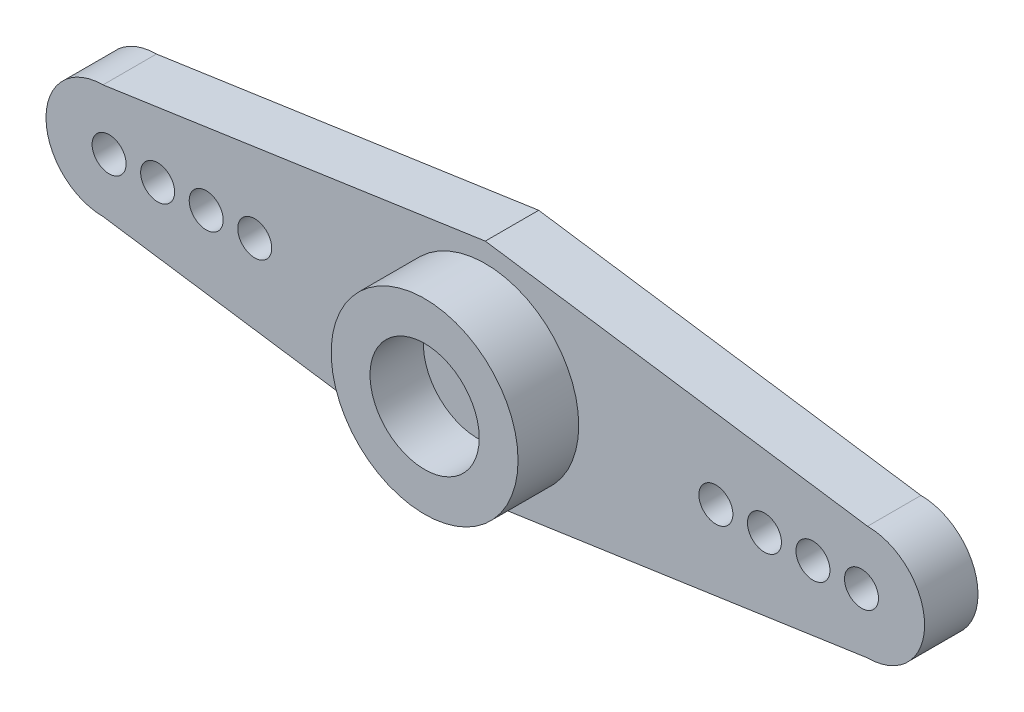
ISO-10303-21;
HEADER;
FILE_DESCRIPTION(('STEP AP214'),'2;1');
FILE_NAME('part.step','',(''),(''),'','','');
FILE_SCHEMA(('AUTOMOTIVE_DESIGN { 1 0 10303 214 1 1 1 1 }'));
ENDSEC;
DATA;
#1=APPLICATION_CONTEXT('core data for automotive mechanical design processes');
#2=APPLICATION_PROTOCOL_DEFINITION('international standard','automotive_design',2000,#1);
#3=PRODUCT_CONTEXT('',#1,'mechanical');
#4=PRODUCT('Part','Part','',(#3));
#5=PRODUCT_RELATED_PRODUCT_CATEGORY('part','',(#4));
#6=PRODUCT_DEFINITION_FORMATION('','',#4);
#7=PRODUCT_DEFINITION_CONTEXT('part definition',#1,'design');
#8=PRODUCT_DEFINITION('design','',#6,#7);
#9=PRODUCT_DEFINITION_SHAPE('','',#8);
#10=(LENGTH_UNIT() NAMED_UNIT(*) SI_UNIT(.MILLI.,.METRE.));
#11=(NAMED_UNIT(*) PLANE_ANGLE_UNIT() SI_UNIT($,.RADIAN.));
#12=(NAMED_UNIT(*) SI_UNIT($,.STERADIAN.) SOLID_ANGLE_UNIT());
#13=UNCERTAINTY_MEASURE_WITH_UNIT(LENGTH_MEASURE(1.E-05),#10,'distance_accuracy_value','');
#14=(GEOMETRIC_REPRESENTATION_CONTEXT(3) GLOBAL_UNCERTAINTY_ASSIGNED_CONTEXT((#13)) GLOBAL_UNIT_ASSIGNED_CONTEXT((#10,
#11,#12)) REPRESENTATION_CONTEXT('',''));
#15=CARTESIAN_POINT('',(0.,0.,0.));
#16=DIRECTION('',(0.,0.,1.));
#17=DIRECTION('',(1.,0.,0.));
#18=AXIS2_PLACEMENT_3D('',#15,#16,#17);
#19=CARTESIAN_POINT('',(22.987,5.9055,0.));
#20=DIRECTION('',(0.,0.,-1.));
#21=DIRECTION('',(-1.,0.,0.));
#22=AXIS2_PLACEMENT_3D('',#19,#20,#21);
#23=PLANE('',#22);
#24=CARTESIAN_POINT('',(-19.685,0.,0.));
#25=DIRECTION('',(0.,0.,-1.));
#26=DIRECTION('',(-1.,0.,0.));
#27=AXIS2_PLACEMENT_3D('',#24,#25,#26);
#28=CIRCLE('',#27,0.888999999999987);
#29=CARTESIAN_POINT('',(-20.574,0.,0.));
#30=VERTEX_POINT('',#29);
#31=EDGE_CURVE('E139',#30,#30,#28,.T.);
#32=ORIENTED_EDGE('',*,*,#31,.F.);
#33=EDGE_LOOP('',(#32));
#34=FACE_BOUND('',#33,.T.);
#35=CARTESIAN_POINT('',(-17.145,0.,0.));
#36=DIRECTION('',(0.,0.,-1.));
#37=DIRECTION('',(-1.,0.,0.));
#38=AXIS2_PLACEMENT_3D('',#35,#36,#37);
#39=CIRCLE('',#38,0.888999999999987);
#40=CARTESIAN_POINT('',(-18.034,0.,0.));
#41=VERTEX_POINT('',#40);
#42=EDGE_CURVE('E143',#41,#41,#39,.T.);
#43=ORIENTED_EDGE('',*,*,#42,.F.);
#44=EDGE_LOOP('',(#43));
#45=FACE_BOUND('',#44,.T.);
#46=CARTESIAN_POINT('',(-14.605,0.,0.));
#47=DIRECTION('',(0.,0.,-1.));
#48=DIRECTION('',(-1.,0.,0.));
#49=AXIS2_PLACEMENT_3D('',#46,#47,#48);
#50=CIRCLE('',#49,0.888999999999989);
#51=CARTESIAN_POINT('',(-15.494,0.,0.));
#52=VERTEX_POINT('',#51);
#53=EDGE_CURVE('E147',#52,#52,#50,.T.);
#54=ORIENTED_EDGE('',*,*,#53,.F.);
#55=EDGE_LOOP('',(#54));
#56=FACE_BOUND('',#55,.T.);
#57=CARTESIAN_POINT('',(-12.065,0.,0.));
#58=DIRECTION('',(0.,0.,-1.));
#59=DIRECTION('',(-1.,0.,0.));
#60=AXIS2_PLACEMENT_3D('',#57,#58,#59);
#61=CIRCLE('',#60,0.888999999999989);
#62=CARTESIAN_POINT('',(-12.954,0.,0.));
#63=VERTEX_POINT('',#62);
#64=EDGE_CURVE('E151',#63,#63,#61,.T.);
#65=ORIENTED_EDGE('',*,*,#64,.F.);
#66=EDGE_LOOP('',(#65));
#67=FACE_BOUND('',#66,.T.);
#68=CARTESIAN_POINT('',(19.685,0.,0.));
#69=DIRECTION('',(0.,0.,-1.));
#70=DIRECTION('',(-1.,0.,0.));
#71=AXIS2_PLACEMENT_3D('',#68,#69,#70);
#72=CIRCLE('',#71,0.888999999999987);
#73=CARTESIAN_POINT('',(18.796,0.,0.));
#74=VERTEX_POINT('',#73);
#75=EDGE_CURVE('E155',#74,#74,#72,.T.);
#76=ORIENTED_EDGE('',*,*,#75,.F.);
#77=EDGE_LOOP('',(#76));
#78=FACE_BOUND('',#77,.T.);
#79=CARTESIAN_POINT('',(17.145,0.,0.));
#80=DIRECTION('',(0.,0.,-1.));
#81=DIRECTION('',(-1.,0.,0.));
#82=AXIS2_PLACEMENT_3D('',#79,#80,#81);
#83=CIRCLE('',#82,0.888999999999987);
#84=CARTESIAN_POINT('',(16.256,0.,0.));
#85=VERTEX_POINT('',#84);
#86=EDGE_CURVE('E160',#85,#85,#83,.T.);
#87=ORIENTED_EDGE('',*,*,#86,.F.);
#88=EDGE_LOOP('',(#87));
#89=FACE_BOUND('',#88,.T.);
#90=CARTESIAN_POINT('',(14.605,0.,0.));
#91=DIRECTION('',(0.,0.,-1.));
#92=DIRECTION('',(-1.,0.,0.));
#93=AXIS2_PLACEMENT_3D('',#90,#91,#92);
#94=CIRCLE('',#93,0.888999999999989);
#95=CARTESIAN_POINT('',(13.716,0.,0.));
#96=VERTEX_POINT('',#95);
#97=EDGE_CURVE('E165',#96,#96,#94,.T.);
#98=ORIENTED_EDGE('',*,*,#97,.F.);
#99=EDGE_LOOP('',(#98));
#100=FACE_BOUND('',#99,.T.);
#101=CARTESIAN_POINT('',(12.065,0.,0.));
#102=DIRECTION('',(0.,0.,-1.));
#103=DIRECTION('',(-1.,0.,0.));
#104=AXIS2_PLACEMENT_3D('',#101,#102,#103);
#105=CIRCLE('',#104,0.888999999999989);
#106=CARTESIAN_POINT('',(11.176,0.,0.));
#107=VERTEX_POINT('',#106);
#108=EDGE_CURVE('E170',#107,#107,#105,.T.);
#109=ORIENTED_EDGE('',*,*,#108,.F.);
#110=EDGE_LOOP('',(#109));
#111=FACE_BOUND('',#110,.T.);
#112=CARTESIAN_POINT('',(20.0025,0.,0.));
#113=DIRECTION('',(0.,0.,1.));
#114=DIRECTION('',(-1.,0.,0.));
#115=AXIS2_PLACEMENT_3D('',#112,#113,#114);
#116=CIRCLE('',#115,2.9845);
#117=CARTESIAN_POINT('',(20.0025,-2.9845,0.));
#118=VERTEX_POINT('',#117);
#119=CARTESIAN_POINT('',(20.0025,2.9845,0.));
#120=VERTEX_POINT('',#119);
#121=EDGE_CURVE('E57',#118,#120,#116,.T.);
#122=ORIENTED_EDGE('',*,*,#121,.F.);
#123=DIRECTION('',(0.9895049271173,0.144499132213955,0.));
#124=VECTOR('',#123,1.);
#125=CARTESIAN_POINT('',(20.0025,-2.9845,0.));
#126=LINE('',#125,#124);
#127=CARTESIAN_POINT('',(-1.48999871685609E-13,-5.90549999999999,0.));
#128=VERTEX_POINT('',#127);
#129=EDGE_CURVE('E118',#128,#118,#126,.T.);
#130=ORIENTED_EDGE('',*,*,#129,.F.);
#131=DIRECTION('',(-0.9895049271173,0.144499132213955,0.));
#132=VECTOR('',#131,1.);
#133=CARTESIAN_POINT('',(-20.0025,-2.9845,0.));
#134=LINE('',#133,#132);
#135=CARTESIAN_POINT('',(-20.0025,-2.9845,0.));
#136=VERTEX_POINT('',#135);
#137=EDGE_CURVE('E133',#128,#136,#134,.T.);
#138=ORIENTED_EDGE('',*,*,#137,.T.);
#139=CARTESIAN_POINT('',(-20.0025,0.,0.));
#140=DIRECTION('',(0.,0.,-1.));
#141=DIRECTION('',(1.,0.,0.));
#142=AXIS2_PLACEMENT_3D('',#139,#140,#141);
#143=CIRCLE('',#142,2.9845);
#144=CARTESIAN_POINT('',(-20.0025,2.9845,0.));
#145=VERTEX_POINT('',#144);
#146=EDGE_CURVE('E128',#136,#145,#143,.T.);
#147=ORIENTED_EDGE('',*,*,#146,.T.);
#148=DIRECTION('',(0.9895049271173,0.144499132213955,0.));
#149=VECTOR('',#148,1.);
#150=CARTESIAN_POINT('',(-20.0025,2.9845,0.));
#151=LINE('',#150,#149);
#152=CARTESIAN_POINT('',(0.,5.90549999999999,0.));
#153=VERTEX_POINT('',#152);
#154=EDGE_CURVE('E124',#145,#153,#151,.T.);
#155=ORIENTED_EDGE('',*,*,#154,.T.);
#156=DIRECTION('',(-0.9895049271173,0.144499132213955,0.));
#157=VECTOR('',#156,1.);
#158=CARTESIAN_POINT('',(20.0025,2.9845,0.));
#159=LINE('',#158,#157);
#160=EDGE_CURVE('E121',#120,#153,#159,.T.);
#161=ORIENTED_EDGE('',*,*,#160,.F.);
#162=EDGE_LOOP('',(#122,#130,#138,#147,#155,#161));
#163=FACE_BOUND('',#162,.T.);
#164=ADVANCED_FACE('F39',(#34,#45,#56,#67,#78,#89,#100,#111,#163),#23,.T.);
#165=CARTESIAN_POINT('',(0.,0.,2.794));
#166=DIRECTION('',(0.,0.,1.));
#167=DIRECTION('',(1.,0.,0.));
#168=AXIS2_PLACEMENT_3D('',#165,#166,#167);
#169=PLANE('',#168);
#170=CARTESIAN_POINT('',(-19.685,0.,2.794));
#171=DIRECTION('',(0.,0.,1.));
#172=DIRECTION('',(1.,0.,0.));
#173=AXIS2_PLACEMENT_3D('',#170,#171,#172);
#174=CIRCLE('',#173,0.888999999999987);
#175=CARTESIAN_POINT('',(-18.796,0.,2.794));
#176=VERTEX_POINT('',#175);
#177=EDGE_CURVE('E142',#176,#176,#174,.T.);
#178=ORIENTED_EDGE('',*,*,#177,.F.);
#179=EDGE_LOOP('',(#178));
#180=FACE_BOUND('',#179,.T.);
#181=CARTESIAN_POINT('',(-17.145,0.,2.794));
#182=DIRECTION('',(0.,0.,1.));
#183=DIRECTION('',(1.,0.,0.));
#184=AXIS2_PLACEMENT_3D('',#181,#182,#183);
#185=CIRCLE('',#184,0.888999999999987);
#186=CARTESIAN_POINT('',(-16.256,0.,2.794));
#187=VERTEX_POINT('',#186);
#188=EDGE_CURVE('E146',#187,#187,#185,.T.);
#189=ORIENTED_EDGE('',*,*,#188,.F.);
#190=EDGE_LOOP('',(#189));
#191=FACE_BOUND('',#190,.T.);
#192=CARTESIAN_POINT('',(-14.605,0.,2.794));
#193=DIRECTION('',(0.,0.,1.));
#194=DIRECTION('',(1.,0.,0.));
#195=AXIS2_PLACEMENT_3D('',#192,#193,#194);
#196=CIRCLE('',#195,0.888999999999988);
#197=CARTESIAN_POINT('',(-13.716,0.,2.794));
#198=VERTEX_POINT('',#197);
#199=EDGE_CURVE('E150',#198,#198,#196,.T.);
#200=ORIENTED_EDGE('',*,*,#199,.F.);
#201=EDGE_LOOP('',(#200));
#202=FACE_BOUND('',#201,.T.);
#203=CARTESIAN_POINT('',(-12.065,0.,2.794));
#204=DIRECTION('',(0.,0.,1.));
#205=DIRECTION('',(1.,0.,0.));
#206=AXIS2_PLACEMENT_3D('',#203,#204,#205);
#207=CIRCLE('',#206,0.888999999999988);
#208=CARTESIAN_POINT('',(-11.176,0.,2.794));
#209=VERTEX_POINT('',#208);
#210=EDGE_CURVE('E154',#209,#209,#207,.T.);
#211=ORIENTED_EDGE('',*,*,#210,.F.);
#212=EDGE_LOOP('',(#211));
#213=FACE_BOUND('',#212,.T.);
#214=CARTESIAN_POINT('',(19.685,0.,2.794));
#215=DIRECTION('',(0.,0.,1.));
#216=DIRECTION('',(1.,0.,0.));
#217=AXIS2_PLACEMENT_3D('',#214,#215,#216);
#218=CIRCLE('',#217,0.888999999999987);
#219=CARTESIAN_POINT('',(20.574,0.,2.794));
#220=VERTEX_POINT('',#219);
#221=EDGE_CURVE('E159',#220,#220,#218,.T.);
#222=ORIENTED_EDGE('',*,*,#221,.F.);
#223=EDGE_LOOP('',(#222));
#224=FACE_BOUND('',#223,.T.);
#225=CARTESIAN_POINT('',(17.145,0.,2.794));
#226=DIRECTION('',(0.,0.,1.));
#227=DIRECTION('',(1.,0.,0.));
#228=AXIS2_PLACEMENT_3D('',#225,#226,#227);
#229=CIRCLE('',#228,0.888999999999987);
#230=CARTESIAN_POINT('',(18.034,0.,2.794));
#231=VERTEX_POINT('',#230);
#232=EDGE_CURVE('E164',#231,#231,#229,.T.);
#233=ORIENTED_EDGE('',*,*,#232,.F.);
#234=EDGE_LOOP('',(#233));
#235=FACE_BOUND('',#234,.T.);
#236=CARTESIAN_POINT('',(14.605,0.,2.794));
#237=DIRECTION('',(0.,0.,1.));
#238=DIRECTION('',(1.,0.,0.));
#239=AXIS2_PLACEMENT_3D('',#236,#237,#238);
#240=CIRCLE('',#239,0.888999999999988);
#241=CARTESIAN_POINT('',(15.494,0.,2.794));
#242=VERTEX_POINT('',#241);
#243=EDGE_CURVE('E169',#242,#242,#240,.T.);
#244=ORIENTED_EDGE('',*,*,#243,.F.);
#245=EDGE_LOOP('',(#244));
#246=FACE_BOUND('',#245,.T.);
#247=CARTESIAN_POINT('',(12.065,0.,2.794));
#248=DIRECTION('',(0.,0.,1.));
#249=DIRECTION('',(1.,0.,0.));
#250=AXIS2_PLACEMENT_3D('',#247,#248,#249);
#251=CIRCLE('',#250,0.888999999999988);
#252=CARTESIAN_POINT('',(12.954,0.,2.794));
#253=VERTEX_POINT('',#252);
#254=EDGE_CURVE('E174',#253,#253,#251,.T.);
#255=ORIENTED_EDGE('',*,*,#254,.F.);
#256=EDGE_LOOP('',(#255));
#257=FACE_BOUND('',#256,.T.);
#258=CARTESIAN_POINT('',(0.,0.,2.794));
#259=DIRECTION('',(0.,0.,1.));
#260=DIRECTION('',(1.,0.,0.));
#261=AXIS2_PLACEMENT_3D('',#258,#259,#260);
#262=CIRCLE('',#261,4.8895);
#263=CARTESIAN_POINT('',(4.8895,0.,2.794));
#264=VERTEX_POINT('',#263);
#265=EDGE_CURVE('E108',#264,#264,#262,.T.);
#266=ORIENTED_EDGE('',*,*,#265,.F.);
#267=EDGE_LOOP('',(#266));
#268=FACE_BOUND('',#267,.T.);
#269=DIRECTION('',(-0.9895049271173,0.144499132213955,0.));
#270=VECTOR('',#269,1.);
#271=CARTESIAN_POINT('',(-0.844383763728395,-5.78219316466189,2.794));
#272=LINE('',#271,#270);
#273=CARTESIAN_POINT('',(-1.52993049696762E-13,-5.90549999999999,2.794));
#274=VERTEX_POINT('',#273);
#275=CARTESIAN_POINT('',(-20.0025,-2.9845,2.794));
#276=VERTEX_POINT('',#275);
#277=EDGE_CURVE('E47',#274,#276,#272,.T.);
#278=ORIENTED_EDGE('',*,*,#277,.F.);
#279=DIRECTION('',(0.9895049271173,0.144499132213955,0.));
#280=VECTOR('',#279,1.);
#281=CARTESIAN_POINT('',(0.844383763728409,-5.78219316466188,2.794));
#282=LINE('',#281,#280);
#283=CARTESIAN_POINT('',(20.0025,-2.9845,2.794));
#284=VERTEX_POINT('',#283);
#285=EDGE_CURVE('E117',#274,#284,#282,.T.);
#286=ORIENTED_EDGE('',*,*,#285,.T.);
#287=CARTESIAN_POINT('',(20.0025,0.,2.794));
#288=DIRECTION('',(0.,0.,1.));
#289=DIRECTION('',(1.,0.,0.));
#290=AXIS2_PLACEMENT_3D('',#287,#288,#289);
#291=CIRCLE('',#290,2.9845);
#292=CARTESIAN_POINT('',(20.0025,2.9845,2.794));
#293=VERTEX_POINT('',#292);
#294=EDGE_CURVE('E12',#284,#293,#291,.T.);
#295=ORIENTED_EDGE('',*,*,#294,.T.);
#296=DIRECTION('',(-0.9895049271173,0.144499132213955,0.));
#297=VECTOR('',#296,1.);
#298=CARTESIAN_POINT('',(0.844383763728408,5.78219316466188,2.794));
#299=LINE('',#298,#297);
#300=CARTESIAN_POINT('',(0.,5.9055,2.794));
#301=VERTEX_POINT('',#300);
#302=EDGE_CURVE('E111',#293,#301,#299,.T.);
#303=ORIENTED_EDGE('',*,*,#302,.T.);
#304=DIRECTION('',(0.9895049271173,0.144499132213955,0.));
#305=VECTOR('',#304,1.);
#306=CARTESIAN_POINT('',(-0.844383763728395,5.78219316466188,2.794));
#307=LINE('',#306,#305);
#308=CARTESIAN_POINT('',(-20.0025,2.9845,2.794));
#309=VERTEX_POINT('',#308);
#310=EDGE_CURVE('E95',#309,#301,#307,.T.);
#311=ORIENTED_EDGE('',*,*,#310,.F.);
#312=CARTESIAN_POINT('',(-20.0025,0.,2.794));
#313=DIRECTION('',(0.,0.,1.));
#314=DIRECTION('',(1.,0.,0.));
#315=AXIS2_PLACEMENT_3D('',#312,#313,#314);
#316=CIRCLE('',#315,2.9845);
#317=EDGE_CURVE('E107',#276,#309,#316,.F.);
#318=ORIENTED_EDGE('',*,*,#317,.F.);
#319=EDGE_LOOP('',(#278,#286,#295,#303,#311,#318));
#320=FACE_BOUND('',#319,.T.);
#321=ADVANCED_FACE('F112',(#180,#191,#202,#213,#224,#235,#246,#257,#268,#320),#169,.T.);
#322=CARTESIAN_POINT('',(0.,0.,2.794));
#323=DIRECTION('',(0.,0.,1.));
#324=DIRECTION('',(1.,0.,0.));
#325=AXIS2_PLACEMENT_3D('',#322,#323,#324);
#326=CYLINDRICAL_SURFACE('',#325,4.8895);
#327=ORIENTED_EDGE('',*,*,#265,.T.);
#328=EDGE_LOOP('',(#327));
#329=FACE_BOUND('',#328,.T.);
#330=CARTESIAN_POINT('',(0.,0.,5.969));
#331=DIRECTION('',(0.,0.,1.));
#332=DIRECTION('',(1.,0.,0.));
#333=AXIS2_PLACEMENT_3D('',#330,#331,#332);
#334=CIRCLE('',#333,4.8895);
#335=CARTESIAN_POINT('',(4.8895,0.,5.969));
#336=VERTEX_POINT('',#335);
#337=EDGE_CURVE('E179',#336,#336,#334,.T.);
#338=ORIENTED_EDGE('',*,*,#337,.F.);
#339=EDGE_LOOP('',(#338));
#340=FACE_BOUND('',#339,.T.);
#341=ADVANCED_FACE('F243',(#329,#340),#326,.T.);
#342=CARTESIAN_POINT('',(22.987,5.9055,5.969));
#343=DIRECTION('',(0.,0.,-1.));
#344=DIRECTION('',(-1.,0.,0.));
#345=AXIS2_PLACEMENT_3D('',#342,#343,#344);
#346=PLANE('',#345);
#347=CARTESIAN_POINT('',(0.,0.,5.969));
#348=DIRECTION('',(0.,0.,1.));
#349=DIRECTION('',(1.,0.,0.));
#350=AXIS2_PLACEMENT_3D('',#347,#348,#349);
#351=CIRCLE('',#350,2.8575);
#352=CARTESIAN_POINT('',(2.8575,0.,5.969));
#353=VERTEX_POINT('',#352);
#354=EDGE_CURVE('E180',#353,#353,#351,.T.);
#355=ORIENTED_EDGE('',*,*,#354,.F.);
#356=EDGE_LOOP('',(#355));
#357=FACE_BOUND('',#356,.T.);
#358=ORIENTED_EDGE('',*,*,#337,.T.);
#359=EDGE_LOOP('',(#358));
#360=FACE_BOUND('',#359,.T.);
#361=ADVANCED_FACE('F282',(#357,#360),#346,.F.);
#362=CARTESIAN_POINT('',(0.,0.,3.175));
#363=DIRECTION('',(0.,0.,1.));
#364=DIRECTION('',(1.,0.,0.));
#365=AXIS2_PLACEMENT_3D('',#362,#363,#364);
#366=CYLINDRICAL_SURFACE('',#365,2.8575);
#367=CARTESIAN_POINT('',(0.,0.,3.175));
#368=DIRECTION('',(0.,0.,1.));
#369=DIRECTION('',(1.,0.,0.));
#370=AXIS2_PLACEMENT_3D('',#367,#368,#369);
#371=CIRCLE('',#370,2.8575);
#372=CARTESIAN_POINT('',(2.8575,0.,3.175));
#373=VERTEX_POINT('',#372);
#374=EDGE_CURVE('E175',#373,#373,#371,.T.);
#375=ORIENTED_EDGE('',*,*,#374,.F.);
#376=EDGE_LOOP('',(#375));
#377=FACE_BOUND('',#376,.T.);
#378=ORIENTED_EDGE('',*,*,#354,.T.);
#379=EDGE_LOOP('',(#378));
#380=FACE_BOUND('',#379,.T.);
#381=ADVANCED_FACE('F275',(#377,#380),#366,.F.);
#382=CARTESIAN_POINT('',(0.,0.,3.175));
#383=DIRECTION('',(0.,0.,1.));
#384=DIRECTION('',(1.,0.,0.));
#385=AXIS2_PLACEMENT_3D('',#382,#383,#384);
#386=PLANE('',#385);
#387=ORIENTED_EDGE('',*,*,#374,.T.);
#388=EDGE_LOOP('',(#387));
#389=FACE_BOUND('',#388,.T.);
#390=ADVANCED_FACE('F265',(#389),#386,.T.);
#391=CARTESIAN_POINT('',(12.065,0.,0.));
#392=DIRECTION('',(0.,0.,-1.));
#393=DIRECTION('',(-1.,0.,0.));
#394=AXIS2_PLACEMENT_3D('',#391,#392,#393);
#395=CYLINDRICAL_SURFACE('',#394,0.888999999999988);
#396=ORIENTED_EDGE('',*,*,#254,.T.);
#397=EDGE_LOOP('',(#396));
#398=FACE_BOUND('',#397,.T.);
#399=ORIENTED_EDGE('',*,*,#108,.T.);
#400=EDGE_LOOP('',(#399));
#401=FACE_BOUND('',#400,.T.);
#402=ADVANCED_FACE('F262',(#398,#401),#395,.F.);
#403=CARTESIAN_POINT('',(14.605,0.,0.));
#404=DIRECTION('',(0.,0.,-1.));
#405=DIRECTION('',(-1.,0.,0.));
#406=AXIS2_PLACEMENT_3D('',#403,#404,#405);
#407=CYLINDRICAL_SURFACE('',#406,0.888999999999988);
#408=ORIENTED_EDGE('',*,*,#243,.T.);
#409=EDGE_LOOP('',(#408));
#410=FACE_BOUND('',#409,.T.);
#411=ORIENTED_EDGE('',*,*,#97,.T.);
#412=EDGE_LOOP('',(#411));
#413=FACE_BOUND('',#412,.T.);
#414=ADVANCED_FACE('F264',(#410,#413),#407,.F.);
#415=CARTESIAN_POINT('',(17.145,0.,0.));
#416=DIRECTION('',(0.,0.,-1.));
#417=DIRECTION('',(-1.,0.,0.));
#418=AXIS2_PLACEMENT_3D('',#415,#416,#417);
#419=CYLINDRICAL_SURFACE('',#418,0.888999999999987);
#420=ORIENTED_EDGE('',*,*,#232,.T.);
#421=EDGE_LOOP('',(#420));
#422=FACE_BOUND('',#421,.T.);
#423=ORIENTED_EDGE('',*,*,#86,.T.);
#424=EDGE_LOOP('',(#423));
#425=FACE_BOUND('',#424,.T.);
#426=ADVANCED_FACE('F272',(#422,#425),#419,.F.);
#427=CARTESIAN_POINT('',(19.685,0.,0.));
#428=DIRECTION('',(0.,0.,-1.));
#429=DIRECTION('',(-1.,0.,0.));
#430=AXIS2_PLACEMENT_3D('',#427,#428,#429);
#431=CYLINDRICAL_SURFACE('',#430,0.888999999999987);
#432=ORIENTED_EDGE('',*,*,#221,.T.);
#433=EDGE_LOOP('',(#432));
#434=FACE_BOUND('',#433,.T.);
#435=ORIENTED_EDGE('',*,*,#75,.T.);
#436=EDGE_LOOP('',(#435));
#437=FACE_BOUND('',#436,.T.);
#438=ADVANCED_FACE('F324',(#434,#437),#431,.F.);
#439=CARTESIAN_POINT('',(-12.065,0.,0.));
#440=DIRECTION('',(0.,0.,-1.));
#441=DIRECTION('',(-1.,0.,0.));
#442=AXIS2_PLACEMENT_3D('',#439,#440,#441);
#443=CYLINDRICAL_SURFACE('',#442,0.888999999999988);
#444=ORIENTED_EDGE('',*,*,#210,.T.);
#445=EDGE_LOOP('',(#444));
#446=FACE_BOUND('',#445,.T.);
#447=ORIENTED_EDGE('',*,*,#64,.T.);
#448=EDGE_LOOP('',(#447));
#449=FACE_BOUND('',#448,.T.);
#450=ADVANCED_FACE('F333',(#446,#449),#443,.F.);
#451=CARTESIAN_POINT('',(-14.605,0.,0.));
#452=DIRECTION('',(0.,0.,-1.));
#453=DIRECTION('',(-1.,0.,0.));
#454=AXIS2_PLACEMENT_3D('',#451,#452,#453);
#455=CYLINDRICAL_SURFACE('',#454,0.888999999999988);
#456=ORIENTED_EDGE('',*,*,#199,.T.);
#457=EDGE_LOOP('',(#456));
#458=FACE_BOUND('',#457,.T.);
#459=ORIENTED_EDGE('',*,*,#53,.T.);
#460=EDGE_LOOP('',(#459));
#461=FACE_BOUND('',#460,.T.);
#462=ADVANCED_FACE('F343',(#458,#461),#455,.F.);
#463=CARTESIAN_POINT('',(-17.145,0.,0.));
#464=DIRECTION('',(0.,0.,-1.));
#465=DIRECTION('',(-1.,0.,0.));
#466=AXIS2_PLACEMENT_3D('',#463,#464,#465);
#467=CYLINDRICAL_SURFACE('',#466,0.888999999999987);
#468=ORIENTED_EDGE('',*,*,#188,.T.);
#469=EDGE_LOOP('',(#468));
#470=FACE_BOUND('',#469,.T.);
#471=ORIENTED_EDGE('',*,*,#42,.T.);
#472=EDGE_LOOP('',(#471));
#473=FACE_BOUND('',#472,.T.);
#474=ADVANCED_FACE('F353',(#470,#473),#467,.F.);
#475=CARTESIAN_POINT('',(-19.685,0.,0.));
#476=DIRECTION('',(0.,0.,-1.));
#477=DIRECTION('',(-1.,0.,0.));
#478=AXIS2_PLACEMENT_3D('',#475,#476,#477);
#479=CYLINDRICAL_SURFACE('',#478,0.888999999999987);
#480=ORIENTED_EDGE('',*,*,#177,.T.);
#481=EDGE_LOOP('',(#480));
#482=FACE_BOUND('',#481,.T.);
#483=ORIENTED_EDGE('',*,*,#31,.T.);
#484=EDGE_LOOP('',(#483));
#485=FACE_BOUND('',#484,.T.);
#486=ADVANCED_FACE('F363',(#482,#485),#479,.F.);
#487=CARTESIAN_POINT('',(-20.0025,-2.9845,0.));
#488=DIRECTION('',(0.144499132213955,0.9895049271173,0.));
#489=DIRECTION('',(-0.9895049271173,0.144499132213955,0.));
#490=AXIS2_PLACEMENT_3D('',#487,#488,#489);
#491=PLANE('',#490);
#492=DIRECTION('',(0.,0.,1.));
#493=VECTOR('',#492,1.);
#494=CARTESIAN_POINT('',(0.,-5.9055,0.));
#495=LINE('',#494,#493);
#496=EDGE_CURVE('E136',#128,#274,#495,.T.);
#497=ORIENTED_EDGE('',*,*,#496,.T.);
#498=ORIENTED_EDGE('',*,*,#277,.T.);
#499=DIRECTION('',(0.,0.,1.));
#500=VECTOR('',#499,1.);
#501=CARTESIAN_POINT('',(-20.0025,-2.9845,0.));
#502=LINE('',#501,#500);
#503=EDGE_CURVE('E123',#136,#276,#502,.T.);
#504=ORIENTED_EDGE('',*,*,#503,.F.);
#505=ORIENTED_EDGE('',*,*,#137,.F.);
#506=EDGE_LOOP('',(#497,#498,#504,#505));
#507=FACE_BOUND('',#506,.T.);
#508=ADVANCED_FACE('F213',(#507),#491,.F.);
#509=CARTESIAN_POINT('',(-20.0025,0.,0.));
#510=DIRECTION('',(0.,0.,1.));
#511=DIRECTION('',(1.,0.,0.));
#512=AXIS2_PLACEMENT_3D('',#509,#510,#511);
#513=CYLINDRICAL_SURFACE('',#512,2.9845);
#514=ORIENTED_EDGE('',*,*,#503,.T.);
#515=ORIENTED_EDGE('',*,*,#317,.T.);
#516=DIRECTION('',(0.,0.,1.));
#517=VECTOR('',#516,1.);
#518=CARTESIAN_POINT('',(-20.0025,2.9845,0.));
#519=LINE('',#518,#517);
#520=EDGE_CURVE('E103',#145,#309,#519,.T.);
#521=ORIENTED_EDGE('',*,*,#520,.F.);
#522=ORIENTED_EDGE('',*,*,#146,.F.);
#523=EDGE_LOOP('',(#514,#515,#521,#522));
#524=FACE_BOUND('',#523,.T.);
#525=ADVANCED_FACE('F219',(#524),#513,.T.);
#526=CARTESIAN_POINT('',(-20.0025,2.9845,0.));
#527=DIRECTION('',(0.144499132213955,-0.9895049271173,0.));
#528=DIRECTION('',(0.9895049271173,0.144499132213955,0.));
#529=AXIS2_PLACEMENT_3D('',#526,#527,#528);
#530=PLANE('',#529);
#531=ORIENTED_EDGE('',*,*,#520,.T.);
#532=ORIENTED_EDGE('',*,*,#310,.T.);
#533=DIRECTION('',(0.,0.,1.));
#534=VECTOR('',#533,1.);
#535=CARTESIAN_POINT('',(0.,5.9055,0.));
#536=LINE('',#535,#534);
#537=EDGE_CURVE('E100',#153,#301,#536,.T.);
#538=ORIENTED_EDGE('',*,*,#537,.F.);
#539=ORIENTED_EDGE('',*,*,#154,.F.);
#540=EDGE_LOOP('',(#531,#532,#538,#539));
#541=FACE_BOUND('',#540,.T.);
#542=ADVANCED_FACE('F97',(#541),#530,.F.);
#543=CARTESIAN_POINT('',(20.0025,-2.9845,0.));
#544=DIRECTION('',(0.144499132213955,-0.9895049271173,0.));
#545=DIRECTION('',(0.9895049271173,0.144499132213955,0.));
#546=AXIS2_PLACEMENT_3D('',#543,#544,#545);
#547=PLANE('',#546);
#548=ORIENTED_EDGE('',*,*,#285,.F.);
#549=ORIENTED_EDGE('',*,*,#496,.F.);
#550=ORIENTED_EDGE('',*,*,#129,.T.);
#551=DIRECTION('',(0.,0.,1.));
#552=VECTOR('',#551,1.);
#553=CARTESIAN_POINT('',(20.0025,-2.9845,0.));
#554=LINE('',#553,#552);
#555=EDGE_CURVE('E223',#118,#284,#554,.T.);
#556=ORIENTED_EDGE('',*,*,#555,.T.);
#557=EDGE_LOOP('',(#548,#549,#550,#556));
#558=FACE_BOUND('',#557,.T.);
#559=ADVANCED_FACE('F237',(#558),#547,.T.);
#560=CARTESIAN_POINT('',(20.0025,0.,0.));
#561=DIRECTION('',(0.,0.,1.));
#562=DIRECTION('',(1.,0.,0.));
#563=AXIS2_PLACEMENT_3D('',#560,#561,#562);
#564=CYLINDRICAL_SURFACE('',#563,2.9845);
#565=ORIENTED_EDGE('',*,*,#294,.F.);
#566=ORIENTED_EDGE('',*,*,#555,.F.);
#567=ORIENTED_EDGE('',*,*,#121,.T.);
#568=DIRECTION('',(0.,0.,1.));
#569=VECTOR('',#568,1.);
#570=CARTESIAN_POINT('',(20.0025,2.9845,0.));
#571=LINE('',#570,#569);
#572=EDGE_CURVE('E227',#120,#293,#571,.T.);
#573=ORIENTED_EDGE('',*,*,#572,.T.);
#574=EDGE_LOOP('',(#565,#566,#567,#573));
#575=FACE_BOUND('',#574,.T.);
#576=ADVANCED_FACE('F417',(#575),#564,.T.);
#577=CARTESIAN_POINT('',(20.0025,2.9845,0.));
#578=DIRECTION('',(0.144499132213955,0.9895049271173,0.));
#579=DIRECTION('',(-0.9895049271173,0.144499132213955,0.));
#580=AXIS2_PLACEMENT_3D('',#577,#578,#579);
#581=PLANE('',#580);
#582=ORIENTED_EDGE('',*,*,#302,.F.);
#583=ORIENTED_EDGE('',*,*,#572,.F.);
#584=ORIENTED_EDGE('',*,*,#160,.T.);
#585=ORIENTED_EDGE('',*,*,#537,.T.);
#586=EDGE_LOOP('',(#582,#583,#584,#585));
#587=FACE_BOUND('',#586,.T.);
#588=ADVANCED_FACE('F120',(#587),#581,.T.);
#589=CLOSED_SHELL('',(#164,#321,#341,#361,#381,#390,#402,#414,#426,#438,#450,#462,#474,#486,
#508,#525,#542,#559,#576,#588));
#590=MANIFOLD_SOLID_BREP('B2',#589);
#591=ADVANCED_BREP_SHAPE_REPRESENTATION('',(#18,#590),#14);
#592=SHAPE_DEFINITION_REPRESENTATION(#9,#591);
ENDSEC;
END-ISO-10303-21;
